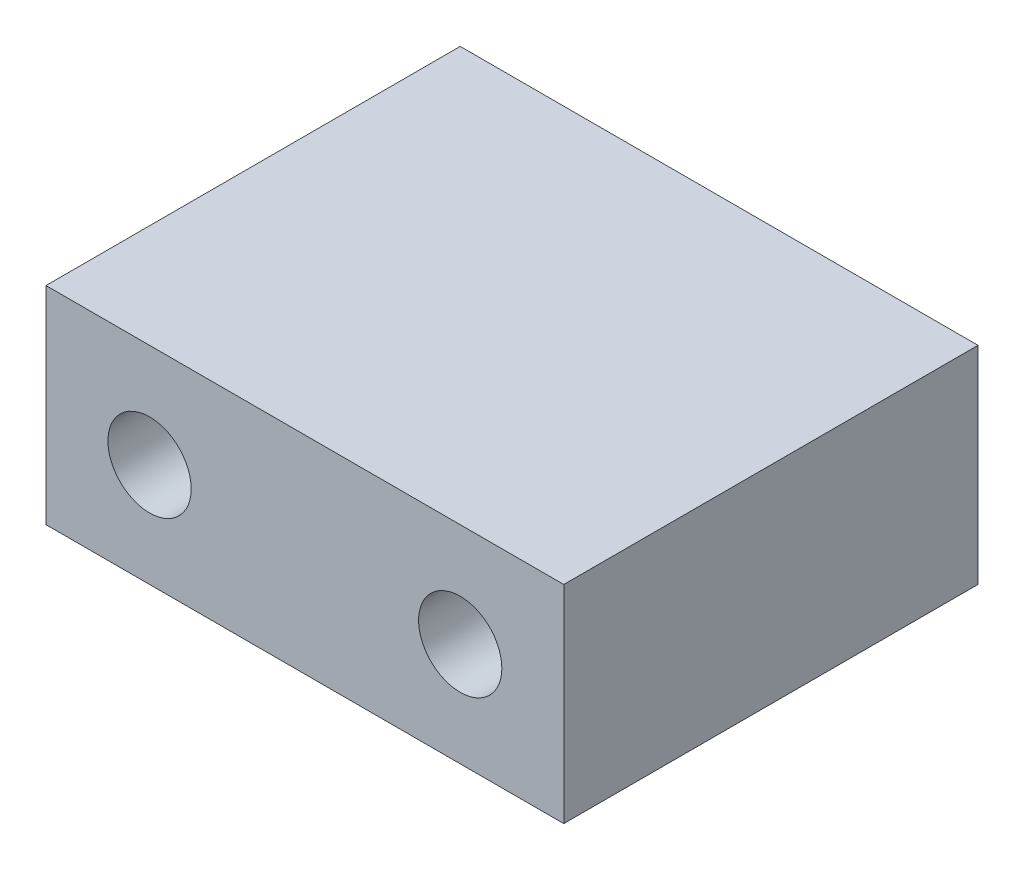
ISO-10303-21;
HEADER;
FILE_DESCRIPTION(('STEP AP214'),'2;1');
FILE_NAME('part.step','',(''),(''),'','','');
FILE_SCHEMA(('AUTOMOTIVE_DESIGN { 1 0 10303 214 1 1 1 1 }'));
ENDSEC;
DATA;
#1=APPLICATION_CONTEXT('core data for automotive mechanical design processes');
#2=APPLICATION_PROTOCOL_DEFINITION('international standard','automotive_design',2000,#1);
#3=PRODUCT_CONTEXT('',#1,'mechanical');
#4=PRODUCT('Part','Part','',(#3));
#5=PRODUCT_RELATED_PRODUCT_CATEGORY('part','',(#4));
#6=PRODUCT_DEFINITION_FORMATION('','',#4);
#7=PRODUCT_DEFINITION_CONTEXT('part definition',#1,'design');
#8=PRODUCT_DEFINITION('design','',#6,#7);
#9=PRODUCT_DEFINITION_SHAPE('','',#8);
#10=(LENGTH_UNIT() NAMED_UNIT(*) SI_UNIT(.MILLI.,.METRE.));
#11=(NAMED_UNIT(*) PLANE_ANGLE_UNIT() SI_UNIT($,.RADIAN.));
#12=(NAMED_UNIT(*) SI_UNIT($,.STERADIAN.) SOLID_ANGLE_UNIT());
#13=UNCERTAINTY_MEASURE_WITH_UNIT(LENGTH_MEASURE(1.E-05),#10,'distance_accuracy_value','');
#14=(GEOMETRIC_REPRESENTATION_CONTEXT(3) GLOBAL_UNCERTAINTY_ASSIGNED_CONTEXT((#13)) GLOBAL_UNIT_ASSIGNED_CONTEXT((#10,
#11,#12)) REPRESENTATION_CONTEXT('',''));
#15=CARTESIAN_POINT('',(0.,0.,0.));
#16=DIRECTION('',(0.,0.,1.));
#17=DIRECTION('',(1.,0.,0.));
#18=AXIS2_PLACEMENT_3D('',#15,#16,#17);
#19=CARTESIAN_POINT('',(-15.875,-6.35,25.4));
#20=DIRECTION('',(1.,0.,0.));
#21=DIRECTION('',(0.,0.,-1.));
#22=AXIS2_PLACEMENT_3D('',#19,#20,#21);
#23=PLANE('',#22);
#24=DIRECTION('',(0.,-1.,0.));
#25=VECTOR('',#24,1.);
#26=CARTESIAN_POINT('',(-15.875,-6.35,0.));
#27=LINE('',#26,#25);
#28=CARTESIAN_POINT('',(-15.875,6.35,0.));
#29=VERTEX_POINT('',#28);
#30=CARTESIAN_POINT('',(-15.875,-6.35,0.));
#31=VERTEX_POINT('',#30);
#32=EDGE_CURVE('E112',#29,#31,#27,.T.);
#33=ORIENTED_EDGE('',*,*,#32,.T.);
#34=DIRECTION('',(0.,0.,-1.));
#35=VECTOR('',#34,1.);
#36=CARTESIAN_POINT('',(-15.875,-6.35,25.4));
#37=LINE('',#36,#35);
#38=CARTESIAN_POINT('',(-15.875,-6.35,25.4));
#39=VERTEX_POINT('',#38);
#40=EDGE_CURVE('E11',#39,#31,#37,.T.);
#41=ORIENTED_EDGE('',*,*,#40,.F.);
#42=DIRECTION('',(0.,-1.,0.));
#43=VECTOR('',#42,1.);
#44=CARTESIAN_POINT('',(-15.875,-6.35,25.4));
#45=LINE('',#44,#43);
#46=CARTESIAN_POINT('',(-15.875,6.35,25.4));
#47=VERTEX_POINT('',#46);
#48=EDGE_CURVE('E113',#47,#39,#45,.T.);
#49=ORIENTED_EDGE('',*,*,#48,.F.);
#50=DIRECTION('',(0.,0.,-1.));
#51=VECTOR('',#50,1.);
#52=CARTESIAN_POINT('',(-15.875,6.35,25.4));
#53=LINE('',#52,#51);
#54=EDGE_CURVE('E119',#47,#29,#53,.T.);
#55=ORIENTED_EDGE('',*,*,#54,.T.);
#56=EDGE_LOOP('',(#33,#41,#49,#55));
#57=FACE_BOUND('',#56,.T.);
#58=ADVANCED_FACE('F37',(#57),#23,.F.);
#59=CARTESIAN_POINT('',(15.875,-6.35,25.4));
#60=DIRECTION('',(0.,1.,0.));
#61=DIRECTION('',(-1.,0.,0.));
#62=AXIS2_PLACEMENT_3D('',#59,#60,#61);
#63=PLANE('',#62);
#64=DIRECTION('',(1.,0.,0.));
#65=VECTOR('',#64,1.);
#66=CARTESIAN_POINT('',(15.875,-6.35,0.));
#67=LINE('',#66,#65);
#68=CARTESIAN_POINT('',(15.875,-6.35,0.));
#69=VERTEX_POINT('',#68);
#70=EDGE_CURVE('E122',#31,#69,#67,.T.);
#71=ORIENTED_EDGE('',*,*,#70,.T.);
#72=DIRECTION('',(0.,0.,-1.));
#73=VECTOR('',#72,1.);
#74=CARTESIAN_POINT('',(15.875,-6.35,25.4));
#75=LINE('',#74,#73);
#76=CARTESIAN_POINT('',(15.875,-6.35,25.4));
#77=VERTEX_POINT('',#76);
#78=EDGE_CURVE('E45',#77,#69,#75,.T.);
#79=ORIENTED_EDGE('',*,*,#78,.F.);
#80=DIRECTION('',(1.,0.,0.));
#81=VECTOR('',#80,1.);
#82=CARTESIAN_POINT('',(15.875,-6.35,25.4));
#83=LINE('',#82,#81);
#84=EDGE_CURVE('E84',#39,#77,#83,.T.);
#85=ORIENTED_EDGE('',*,*,#84,.F.);
#86=ORIENTED_EDGE('',*,*,#40,.T.);
#87=EDGE_LOOP('',(#71,#79,#85,#86));
#88=FACE_BOUND('',#87,.T.);
#89=ADVANCED_FACE('F146',(#88),#63,.F.);
#90=CARTESIAN_POINT('',(15.875,-6.35,25.4));
#91=DIRECTION('',(-1.,0.,0.));
#92=DIRECTION('',(0.,0.,1.));
#93=AXIS2_PLACEMENT_3D('',#90,#91,#92);
#94=PLANE('',#93);
#95=DIRECTION('',(0.,1.,0.));
#96=VECTOR('',#95,1.);
#97=CARTESIAN_POINT('',(15.875,-6.35,0.));
#98=LINE('',#97,#96);
#99=CARTESIAN_POINT('',(15.875,6.35,0.));
#100=VERTEX_POINT('',#99);
#101=EDGE_CURVE('E71',#69,#100,#98,.T.);
#102=ORIENTED_EDGE('',*,*,#101,.T.);
#103=DIRECTION('',(0.,0.,-1.));
#104=VECTOR('',#103,1.);
#105=CARTESIAN_POINT('',(15.875,6.35,25.4));
#106=LINE('',#105,#104);
#107=CARTESIAN_POINT('',(15.875,6.35,25.4));
#108=VERTEX_POINT('',#107);
#109=EDGE_CURVE('E127',#108,#100,#106,.T.);
#110=ORIENTED_EDGE('',*,*,#109,.F.);
#111=DIRECTION('',(0.,1.,0.));
#112=VECTOR('',#111,1.);
#113=CARTESIAN_POINT('',(15.875,-6.35,25.4));
#114=LINE('',#113,#112);
#115=EDGE_CURVE('E116',#77,#108,#114,.T.);
#116=ORIENTED_EDGE('',*,*,#115,.F.);
#117=ORIENTED_EDGE('',*,*,#78,.T.);
#118=EDGE_LOOP('',(#102,#110,#116,#117));
#119=FACE_BOUND('',#118,.T.);
#120=ADVANCED_FACE('F129',(#119),#94,.F.);
#121=CARTESIAN_POINT('',(15.875,6.35,25.4));
#122=DIRECTION('',(0.,-1.,0.));
#123=DIRECTION('',(1.,0.,0.));
#124=AXIS2_PLACEMENT_3D('',#121,#122,#123);
#125=PLANE('',#124);
#126=DIRECTION('',(-1.,0.,0.));
#127=VECTOR('',#126,1.);
#128=CARTESIAN_POINT('',(15.875,6.35,0.));
#129=LINE('',#128,#127);
#130=EDGE_CURVE('E77',#100,#29,#129,.T.);
#131=ORIENTED_EDGE('',*,*,#130,.T.);
#132=ORIENTED_EDGE('',*,*,#54,.F.);
#133=DIRECTION('',(-1.,0.,0.));
#134=VECTOR('',#133,1.);
#135=CARTESIAN_POINT('',(15.875,6.35,25.4));
#136=LINE('',#135,#134);
#137=EDGE_CURVE('E53',#108,#47,#136,.T.);
#138=ORIENTED_EDGE('',*,*,#137,.F.);
#139=ORIENTED_EDGE('',*,*,#109,.T.);
#140=EDGE_LOOP('',(#131,#132,#138,#139));
#141=FACE_BOUND('',#140,.T.);
#142=ADVANCED_FACE('F136',(#141),#125,.F.);
#143=CARTESIAN_POINT('',(0.,0.,25.4));
#144=DIRECTION('',(0.,0.,1.));
#145=DIRECTION('',(1.,0.,0.));
#146=AXIS2_PLACEMENT_3D('',#143,#144,#145);
#147=PLANE('',#146);
#148=CARTESIAN_POINT('',(-9.525,0.,25.4));
#149=DIRECTION('',(0.,0.,1.));
#150=DIRECTION('',(1.,0.,0.));
#151=AXIS2_PLACEMENT_3D('',#148,#149,#150);
#152=CIRCLE('',#151,2.5527);
#153=CARTESIAN_POINT('',(-6.9723,0.,25.4));
#154=VERTEX_POINT('',#153);
#155=EDGE_CURVE('E102',#154,#154,#152,.T.);
#156=ORIENTED_EDGE('',*,*,#155,.F.);
#157=EDGE_LOOP('',(#156));
#158=FACE_BOUND('',#157,.T.);
#159=CARTESIAN_POINT('',(9.525,0.,25.4));
#160=DIRECTION('',(0.,0.,1.));
#161=DIRECTION('',(1.,0.,0.));
#162=AXIS2_PLACEMENT_3D('',#159,#160,#161);
#163=CIRCLE('',#162,2.5527);
#164=CARTESIAN_POINT('',(12.0777,0.,25.4));
#165=VERTEX_POINT('',#164);
#166=EDGE_CURVE('E101',#165,#165,#163,.T.);
#167=ORIENTED_EDGE('',*,*,#166,.F.);
#168=EDGE_LOOP('',(#167));
#169=FACE_BOUND('',#168,.T.);
#170=ORIENTED_EDGE('',*,*,#48,.T.);
#171=ORIENTED_EDGE('',*,*,#84,.T.);
#172=ORIENTED_EDGE('',*,*,#115,.T.);
#173=ORIENTED_EDGE('',*,*,#137,.T.);
#174=EDGE_LOOP('',(#170,#171,#172,#173));
#175=FACE_BOUND('',#174,.T.);
#176=ADVANCED_FACE('F138',(#158,#169,#175),#147,.T.);
#177=CARTESIAN_POINT('',(0.,0.,0.));
#178=DIRECTION('',(0.,0.,1.));
#179=DIRECTION('',(1.,0.,0.));
#180=AXIS2_PLACEMENT_3D('',#177,#178,#179);
#181=PLANE('',#180);
#182=ORIENTED_EDGE('',*,*,#32,.F.);
#183=ORIENTED_EDGE('',*,*,#130,.F.);
#184=ORIENTED_EDGE('',*,*,#101,.F.);
#185=ORIENTED_EDGE('',*,*,#70,.F.);
#186=EDGE_LOOP('',(#182,#183,#184,#185));
#187=FACE_BOUND('',#186,.T.);
#188=ADVANCED_FACE('F132',(#187),#181,.F.);
#189=CARTESIAN_POINT('',(9.525,0.,8.89));
#190=DIRECTION('',(0.,0.,1.));
#191=DIRECTION('',(1.,0.,0.));
#192=AXIS2_PLACEMENT_3D('',#189,#190,#191);
#193=CONICAL_SURFACE('',#192,2.5527,1.02974425867665);
#194=CARTESIAN_POINT('',(9.525,0.,7.35618309780834));
#195=VERTEX_POINT('',#194);
#196=VERTEX_LOOP('',#195);
#197=FACE_BOUND('',#196,.T.);
#198=CARTESIAN_POINT('',(9.525,0.,8.89));
#199=DIRECTION('',(0.,0.,1.));
#200=DIRECTION('',(1.,0.,0.));
#201=AXIS2_PLACEMENT_3D('',#198,#199,#200);
#202=CIRCLE('',#201,2.5527);
#203=CARTESIAN_POINT('',(12.0777,0.,8.89));
#204=VERTEX_POINT('',#203);
#205=EDGE_CURVE('E105',#204,#204,#202,.T.);
#206=ORIENTED_EDGE('',*,*,#205,.T.);
#207=EDGE_LOOP('',(#206));
#208=FACE_BOUND('',#207,.T.);
#209=ADVANCED_FACE('F173',(#197,#208),#193,.F.);
#210=CARTESIAN_POINT('',(9.525,0.,25.4));
#211=DIRECTION('',(0.,0.,1.));
#212=DIRECTION('',(1.,0.,0.));
#213=AXIS2_PLACEMENT_3D('',#210,#211,#212);
#214=CYLINDRICAL_SURFACE('',#213,2.5527);
#215=ORIENTED_EDGE('',*,*,#205,.F.);
#216=EDGE_LOOP('',(#215));
#217=FACE_BOUND('',#216,.T.);
#218=ORIENTED_EDGE('',*,*,#166,.T.);
#219=EDGE_LOOP('',(#218));
#220=FACE_BOUND('',#219,.T.);
#221=ADVANCED_FACE('F95',(#217,#220),#214,.F.);
#222=CARTESIAN_POINT('',(-9.525,0.,8.89));
#223=DIRECTION('',(0.,0.,1.));
#224=DIRECTION('',(1.,0.,0.));
#225=AXIS2_PLACEMENT_3D('',#222,#223,#224);
#226=CONICAL_SURFACE('',#225,2.5527,1.02974425867665);
#227=CARTESIAN_POINT('',(-9.52500000000001,0.,7.35618309780834));
#228=VERTEX_POINT('',#227);
#229=VERTEX_LOOP('',#228);
#230=FACE_BOUND('',#229,.T.);
#231=CARTESIAN_POINT('',(-9.525,0.,8.89));
#232=DIRECTION('',(0.,0.,1.));
#233=DIRECTION('',(1.,0.,0.));
#234=AXIS2_PLACEMENT_3D('',#231,#232,#233);
#235=CIRCLE('',#234,2.5527);
#236=CARTESIAN_POINT('',(-6.9723,0.,8.89));
#237=VERTEX_POINT('',#236);
#238=EDGE_CURVE('E99',#237,#237,#235,.T.);
#239=ORIENTED_EDGE('',*,*,#238,.T.);
#240=EDGE_LOOP('',(#239));
#241=FACE_BOUND('',#240,.T.);
#242=ADVANCED_FACE('F91',(#230,#241),#226,.F.);
#243=CARTESIAN_POINT('',(-9.525,0.,25.4));
#244=DIRECTION('',(0.,0.,1.));
#245=DIRECTION('',(1.,0.,0.));
#246=AXIS2_PLACEMENT_3D('',#243,#244,#245);
#247=CYLINDRICAL_SURFACE('',#246,2.5527);
#248=ORIENTED_EDGE('',*,*,#238,.F.);
#249=EDGE_LOOP('',(#248));
#250=FACE_BOUND('',#249,.T.);
#251=ORIENTED_EDGE('',*,*,#155,.T.);
#252=EDGE_LOOP('',(#251));
#253=FACE_BOUND('',#252,.T.);
#254=ADVANCED_FACE('F94',(#250,#253),#247,.F.);
#255=CLOSED_SHELL('',(#58,#89,#120,#142,#176,#188,#209,#221,#242,#254));
#256=MANIFOLD_SOLID_BREP('B2',#255);
#257=ADVANCED_BREP_SHAPE_REPRESENTATION('',(#18,#256),#14);
#258=SHAPE_DEFINITION_REPRESENTATION(#9,#257);
ENDSEC;
END-ISO-10303-21;
